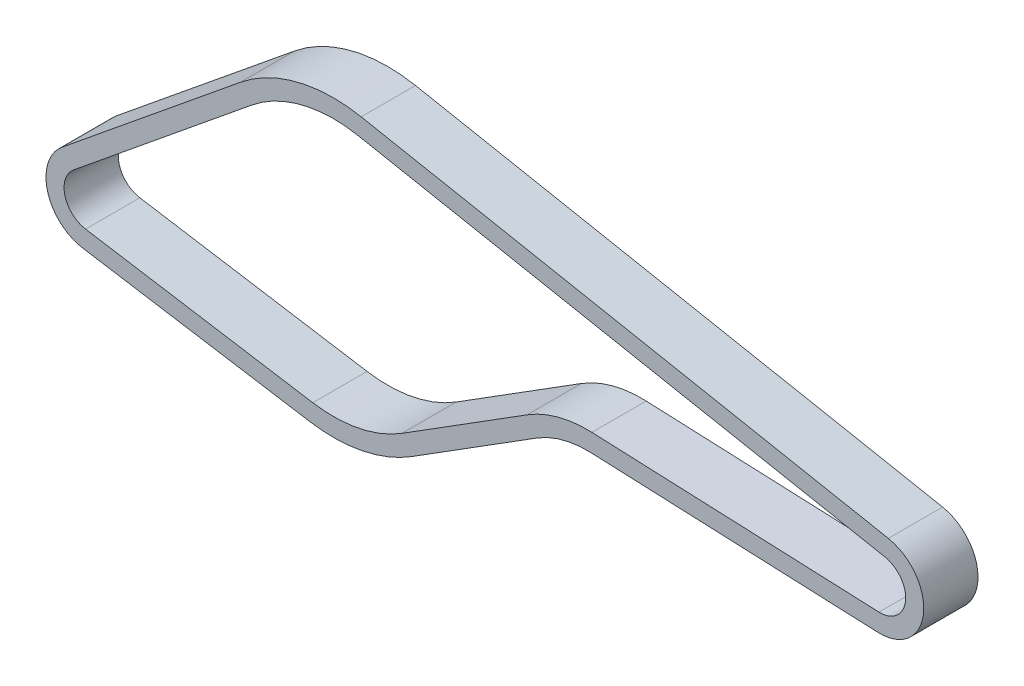
ISO-10303-21;
HEADER;
FILE_DESCRIPTION(('STEP AP214'),'2;1');
FILE_NAME('part.step','',(''),(''),'','','');
FILE_SCHEMA(('AUTOMOTIVE_DESIGN { 1 0 10303 214 1 1 1 1 }'));
ENDSEC;
DATA;
#1=APPLICATION_CONTEXT('core data for automotive mechanical design processes');
#2=APPLICATION_PROTOCOL_DEFINITION('international standard','automotive_design',2000,#1);
#3=PRODUCT_CONTEXT('',#1,'mechanical');
#4=PRODUCT('Part','Part','',(#3));
#5=PRODUCT_RELATED_PRODUCT_CATEGORY('part','',(#4));
#6=PRODUCT_DEFINITION_FORMATION('','',#4);
#7=PRODUCT_DEFINITION_CONTEXT('part definition',#1,'design');
#8=PRODUCT_DEFINITION('design','',#6,#7);
#9=PRODUCT_DEFINITION_SHAPE('','',#8);
#10=(LENGTH_UNIT() NAMED_UNIT(*) SI_UNIT(.MILLI.,.METRE.));
#11=(NAMED_UNIT(*) PLANE_ANGLE_UNIT() SI_UNIT($,.RADIAN.));
#12=(NAMED_UNIT(*) SI_UNIT($,.STERADIAN.) SOLID_ANGLE_UNIT());
#13=UNCERTAINTY_MEASURE_WITH_UNIT(LENGTH_MEASURE(1.E-05),#10,'distance_accuracy_value','');
#14=(GEOMETRIC_REPRESENTATION_CONTEXT(3) GLOBAL_UNCERTAINTY_ASSIGNED_CONTEXT((#13)) GLOBAL_UNIT_ASSIGNED_CONTEXT((#10,
#11,#12)) REPRESENTATION_CONTEXT('',''));
#15=CARTESIAN_POINT('',(0.,0.,0.));
#16=DIRECTION('',(0.,0.,1.));
#17=DIRECTION('',(1.,0.,0.));
#18=AXIS2_PLACEMENT_3D('',#15,#16,#17);
#19=CARTESIAN_POINT('',(42.0896842953628,-20.915508024351,4.5));
#20=DIRECTION('',(0.,0.,-1.));
#21=DIRECTION('',(-1.,0.,0.));
#22=AXIS2_PLACEMENT_3D('',#19,#20,#21);
#23=CYLINDRICAL_SURFACE('',#22,18.7);
#24=CARTESIAN_POINT('',(42.0896842953628,-20.915508024351,-4.5));
#25=DIRECTION('',(0.,0.,1.));
#26=DIRECTION('',(1.,0.,0.));
#27=AXIS2_PLACEMENT_3D('',#24,#25,#26);
#28=CIRCLE('',#27,18.7);
#29=CARTESIAN_POINT('',(42.8799142897922,-2.23221236871512,-4.5));
#30=VERTEX_POINT('',#29);
#31=CARTESIAN_POINT('',(32.1424472331816,-5.08065801468029,-4.5));
#32=VERTEX_POINT('',#31);
#33=EDGE_CURVE('E233',#30,#32,#28,.T.);
#34=ORIENTED_EDGE('',*,*,#33,.T.);
#35=DIRECTION('',(0.,0.,-1.));
#36=VECTOR('',#35,1.);
#37=CARTESIAN_POINT('',(32.1424472331816,-5.08065801468029,4.5));
#38=LINE('',#37,#36);
#39=CARTESIAN_POINT('',(32.1424472331816,-5.08065801468029,4.5));
#40=VERTEX_POINT('',#39);
#41=EDGE_CURVE('E11',#40,#32,#38,.T.);
#42=ORIENTED_EDGE('',*,*,#41,.F.);
#43=CARTESIAN_POINT('',(42.0896842953628,-20.915508024351,4.5));
#44=DIRECTION('',(0.,0.,1.));
#45=DIRECTION('',(1.,0.,0.));
#46=AXIS2_PLACEMENT_3D('',#43,#44,#45);
#47=CIRCLE('',#46,18.7);
#48=CARTESIAN_POINT('',(42.8799142897922,-2.23221236871512,4.5));
#49=VERTEX_POINT('',#48);
#50=EDGE_CURVE('E333',#49,#40,#47,.T.);
#51=ORIENTED_EDGE('',*,*,#50,.F.);
#52=DIRECTION('',(0.,0.,-1.));
#53=VECTOR('',#52,1.);
#54=CARTESIAN_POINT('',(42.8799142897922,-2.23221236871512,4.5));
#55=LINE('',#54,#53);
#56=EDGE_CURVE('E54',#49,#30,#55,.T.);
#57=ORIENTED_EDGE('',*,*,#56,.T.);
#58=EDGE_LOOP('',(#34,#42,#51,#57));
#59=FACE_BOUND('',#58,.T.);
#60=ADVANCED_FACE('F35',(#59),#23,.T.);
#61=CARTESIAN_POINT('',(11.3834691513731,-18.1211652517088,4.5));
#62=DIRECTION('',(-0.531937810811826,0.846783422977045,0.));
#63=DIRECTION('',(-0.846783422977045,-0.531937810811826,0.));
#64=AXIS2_PLACEMENT_3D('',#61,#62,#63);
#65=PLANE('',#64);
#66=DIRECTION('',(0.846783422977045,0.531937810811826,0.));
#67=VECTOR('',#66,1.);
#68=CARTESIAN_POINT('',(11.3834691513731,-18.1211652517088,-4.5));
#69=LINE('',#68,#67);
#70=CARTESIAN_POINT('',(11.3834691513731,-18.1211652517088,-4.5));
#71=VERTEX_POINT('',#70);
#72=EDGE_CURVE('E235',#71,#32,#69,.T.);
#73=ORIENTED_EDGE('',*,*,#72,.F.);
#74=DIRECTION('',(0.,0.,-1.));
#75=VECTOR('',#74,1.);
#76=CARTESIAN_POINT('',(11.3834691513731,-18.1211652517088,4.5));
#77=LINE('',#76,#75);
#78=CARTESIAN_POINT('',(11.3834691513731,-18.1211652517088,4.5));
#79=VERTEX_POINT('',#78);
#80=EDGE_CURVE('E45',#79,#71,#77,.T.);
#81=ORIENTED_EDGE('',*,*,#80,.F.);
#82=DIRECTION('',(0.846783422977045,0.531937810811826,0.));
#83=VECTOR('',#82,1.);
#84=CARTESIAN_POINT('',(11.3834691513731,-18.1211652517088,4.5));
#85=LINE('',#84,#83);
#86=EDGE_CURVE('E335',#79,#40,#85,.T.);
#87=ORIENTED_EDGE('',*,*,#86,.T.);
#88=ORIENTED_EDGE('',*,*,#41,.T.);
#89=EDGE_LOOP('',(#73,#81,#87,#88));
#90=FACE_BOUND('',#89,.T.);
#91=ADVANCED_FACE('F368',(#90),#65,.T.);
#92=CARTESIAN_POINT('',(0.,0.,4.5));
#93=DIRECTION('',(0.,0.,-1.));
#94=DIRECTION('',(-1.,0.,0.));
#95=AXIS2_PLACEMENT_3D('',#92,#93,#94);
#96=CYLINDRICAL_SURFACE('',#95,21.4);
#97=CARTESIAN_POINT('',(0.,0.,-4.5));
#98=DIRECTION('',(0.,0.,1.));
#99=DIRECTION('',(1.,0.,0.));
#100=AXIS2_PLACEMENT_3D('',#97,#98,#99);
#101=CIRCLE('',#100,21.4);
#102=CARTESIAN_POINT('',(-3.41714388648269,-21.1254142600583,-4.5));
#103=VERTEX_POINT('',#102);
#104=EDGE_CURVE('E238',#103,#71,#101,.T.);
#105=ORIENTED_EDGE('',*,*,#104,.F.);
#106=DIRECTION('',(0.,0.,-1.));
#107=VECTOR('',#106,1.);
#108=CARTESIAN_POINT('',(-3.41714388648269,-21.1254142600583,4.5));
#109=LINE('',#108,#107);
#110=CARTESIAN_POINT('',(-3.41714388648269,-21.1254142600583,4.5));
#111=VERTEX_POINT('',#110);
#112=EDGE_CURVE('E268',#111,#103,#109,.T.);
#113=ORIENTED_EDGE('',*,*,#112,.F.);
#114=CARTESIAN_POINT('',(0.,0.,4.5));
#115=DIRECTION('',(0.,0.,1.));
#116=DIRECTION('',(1.,0.,0.));
#117=AXIS2_PLACEMENT_3D('',#114,#115,#116);
#118=CIRCLE('',#117,21.4);
#119=EDGE_CURVE('E338',#111,#79,#118,.T.);
#120=ORIENTED_EDGE('',*,*,#119,.T.);
#121=ORIENTED_EDGE('',*,*,#80,.T.);
#122=EDGE_LOOP('',(#105,#113,#120,#121));
#123=FACE_BOUND('',#122,.T.);
#124=ADVANCED_FACE('F373',(#123),#96,.F.);
#125=CARTESIAN_POINT('',(-3.41714388648268,-21.1254142600583,4.5));
#126=DIRECTION('',(0.159679620863677,0.987168890656929,0.));
#127=DIRECTION('',(-0.987168890656929,0.159679620863677,0.));
#128=AXIS2_PLACEMENT_3D('',#125,#126,#127);
#129=PLANE('',#128);
#130=DIRECTION('',(0.987168890656929,-0.159679620863677,0.));
#131=VECTOR('',#130,1.);
#132=CARTESIAN_POINT('',(-3.41714388648268,-21.1254142600583,-4.5));
#133=LINE('',#132,#131);
#134=CARTESIAN_POINT('',(-41.1085650034415,-15.0286339717694,-4.5));
#135=VERTEX_POINT('',#134);
#136=EDGE_CURVE('E241',#135,#103,#133,.T.);
#137=ORIENTED_EDGE('',*,*,#136,.F.);
#138=DIRECTION('',(0.,0.,-1.));
#139=VECTOR('',#138,1.);
#140=CARTESIAN_POINT('',(-41.1085650034415,-15.0286339717694,4.5));
#141=LINE('',#140,#139);
#142=CARTESIAN_POINT('',(-41.1085650034415,-15.0286339717694,4.5));
#143=VERTEX_POINT('',#142);
#144=EDGE_CURVE('E266',#143,#135,#141,.T.);
#145=ORIENTED_EDGE('',*,*,#144,.F.);
#146=DIRECTION('',(0.987168890656929,-0.159679620863677,0.));
#147=VECTOR('',#146,1.);
#148=CARTESIAN_POINT('',(-3.41714388648268,-21.1254142600583,4.5));
#149=LINE('',#148,#147);
#150=EDGE_CURVE('E341',#143,#111,#149,.T.);
#151=ORIENTED_EDGE('',*,*,#150,.T.);
#152=ORIENTED_EDGE('',*,*,#112,.T.);
#153=EDGE_LOOP('',(#137,#145,#151,#152));
#154=FACE_BOUND('',#153,.T.);
#155=ADVANCED_FACE('F421',(#154),#129,.T.);
#156=CARTESIAN_POINT('',(-40.4299266147709,-10.8331661864775,4.5));
#157=DIRECTION('',(0.,0.,-1.));
#158=DIRECTION('',(-1.,0.,0.));
#159=AXIS2_PLACEMENT_3D('',#156,#157,#158);
#160=CYLINDRICAL_SURFACE('',#159,4.24999999999999);
#161=CARTESIAN_POINT('',(-40.4299266147709,-10.8331661864775,-4.5));
#162=DIRECTION('',(0.,0.,1.));
#163=DIRECTION('',(1.,0.,0.));
#164=AXIS2_PLACEMENT_3D('',#161,#162,#163);
#165=CIRCLE('',#164,4.24999999999999);
#166=CARTESIAN_POINT('',(-43.115378591989,-7.53910369799071,-4.5));
#167=VERTEX_POINT('',#166);
#168=EDGE_CURVE('E244',#167,#135,#165,.T.);
#169=ORIENTED_EDGE('',*,*,#168,.F.);
#170=DIRECTION('',(0.,0.,-1.));
#171=VECTOR('',#170,1.);
#172=CARTESIAN_POINT('',(-43.115378591989,-7.53910369799071,4.5));
#173=LINE('',#172,#171);
#174=CARTESIAN_POINT('',(-43.115378591989,-7.53910369799071,4.5));
#175=VERTEX_POINT('',#174);
#176=EDGE_CURVE('E264',#175,#167,#173,.T.);
#177=ORIENTED_EDGE('',*,*,#176,.F.);
#178=CARTESIAN_POINT('',(-40.4299266147709,-10.8331661864775,4.5));
#179=DIRECTION('',(0.,0.,1.));
#180=DIRECTION('',(1.,0.,0.));
#181=AXIS2_PLACEMENT_3D('',#178,#179,#180);
#182=CIRCLE('',#181,4.24999999999999);
#183=EDGE_CURVE('E344',#175,#143,#182,.T.);
#184=ORIENTED_EDGE('',*,*,#183,.T.);
#185=ORIENTED_EDGE('',*,*,#144,.T.);
#186=EDGE_LOOP('',(#169,#177,#184,#185));
#187=FACE_BOUND('',#186,.T.);
#188=ADVANCED_FACE('F417',(#187),#160,.F.);
#189=CARTESIAN_POINT('',(-13.5220405441099,16.5865734714392,4.5));
#190=DIRECTION('',(-0.631871053463078,0.775073526702764,0.));
#191=DIRECTION('',(-0.775073526702764,-0.631871053463078,0.));
#192=AXIS2_PLACEMENT_3D('',#189,#190,#191);
#193=PLANE('',#192);
#194=DIRECTION('',(0.775073526702764,0.631871053463078,0.));
#195=VECTOR('',#194,1.);
#196=CARTESIAN_POINT('',(-13.5220405441099,16.5865734714392,-4.5));
#197=LINE('',#196,#195);
#198=CARTESIAN_POINT('',(-13.5220405441099,16.5865734714392,-4.5));
#199=VERTEX_POINT('',#198);
#200=EDGE_CURVE('E247',#167,#199,#197,.T.);
#201=ORIENTED_EDGE('',*,*,#200,.T.);
#202=DIRECTION('',(0.,0.,-1.));
#203=VECTOR('',#202,1.);
#204=CARTESIAN_POINT('',(-13.5220405441099,16.5865734714392,4.5));
#205=LINE('',#204,#203);
#206=CARTESIAN_POINT('',(-13.5220405441099,16.5865734714392,4.5));
#207=VERTEX_POINT('',#206);
#208=EDGE_CURVE('E262',#207,#199,#205,.T.);
#209=ORIENTED_EDGE('',*,*,#208,.F.);
#210=DIRECTION('',(0.775073526702764,0.631871053463078,0.));
#211=VECTOR('',#210,1.);
#212=CARTESIAN_POINT('',(-13.5220405441099,16.5865734714392,4.5));
#213=LINE('',#212,#211);
#214=EDGE_CURVE('E347',#175,#207,#213,.T.);
#215=ORIENTED_EDGE('',*,*,#214,.F.);
#216=ORIENTED_EDGE('',*,*,#176,.T.);
#217=EDGE_LOOP('',(#201,#209,#215,#216));
#218=FACE_BOUND('',#217,.T.);
#219=ADVANCED_FACE('F414',(#218),#193,.F.);
#220=CARTESIAN_POINT('',(0.,0.,4.5));
#221=DIRECTION('',(0.,0.,-1.));
#222=DIRECTION('',(-1.,0.,0.));
#223=AXIS2_PLACEMENT_3D('',#220,#221,#222);
#224=CYLINDRICAL_SURFACE('',#223,21.4);
#225=CARTESIAN_POINT('',(0.,0.,-4.5));
#226=DIRECTION('',(0.,0.,1.));
#227=DIRECTION('',(1.,0.,0.));
#228=AXIS2_PLACEMENT_3D('',#225,#226,#227);
#229=CIRCLE('',#228,21.4);
#230=CARTESIAN_POINT('',(4.047486865877,21.0137538310163,-4.5));
#231=VERTEX_POINT('',#230);
#232=EDGE_CURVE('E250',#231,#199,#229,.T.);
#233=ORIENTED_EDGE('',*,*,#232,.F.);
#234=DIRECTION('',(0.,0.,-1.));
#235=VECTOR('',#234,1.);
#236=CARTESIAN_POINT('',(4.047486865877,21.0137538310163,4.5));
#237=LINE('',#236,#235);
#238=CARTESIAN_POINT('',(4.047486865877,21.0137538310163,4.5));
#239=VERTEX_POINT('',#238);
#240=EDGE_CURVE('E198',#239,#231,#237,.T.);
#241=ORIENTED_EDGE('',*,*,#240,.F.);
#242=CARTESIAN_POINT('',(0.,0.,4.5));
#243=DIRECTION('',(0.,0.,1.));
#244=DIRECTION('',(1.,0.,0.));
#245=AXIS2_PLACEMENT_3D('',#242,#243,#244);
#246=CIRCLE('',#245,21.4);
#247=EDGE_CURVE('E188',#239,#207,#246,.T.);
#248=ORIENTED_EDGE('',*,*,#247,.T.);
#249=ORIENTED_EDGE('',*,*,#208,.T.);
#250=EDGE_LOOP('',(#233,#241,#248,#249));
#251=FACE_BOUND('',#250,.T.);
#252=ADVANCED_FACE('F350',(#251),#224,.F.);
#253=CARTESIAN_POINT('',(4.047486865877,21.0137538310163,4.5));
#254=DIRECTION('',(0.189134900274626,0.981951113598894,0.));
#255=DIRECTION('',(-0.981951113598894,0.189134900274626,0.));
#256=AXIS2_PLACEMENT_3D('',#253,#254,#255);
#257=PLANE('',#256);
#258=DIRECTION('',(0.981951113598894,-0.189134900274626,0.));
#259=VECTOR('',#258,1.);
#260=CARTESIAN_POINT('',(4.047486865877,21.0137538310163,-4.5));
#261=LINE('',#260,#259);
#262=CARTESIAN_POINT('',(91.4798433261672,4.1732922327953,-4.5));
#263=VERTEX_POINT('',#262);
#264=EDGE_CURVE('E195',#231,#263,#261,.T.);
#265=ORIENTED_EDGE('',*,*,#264,.T.);
#266=DIRECTION('',(0.,0.,-1.));
#267=VECTOR('',#266,1.);
#268=CARTESIAN_POINT('',(91.4798433261672,4.1732922327953,4.5));
#269=LINE('',#268,#267);
#270=CARTESIAN_POINT('',(91.4798433261672,4.1732922327953,4.5));
#271=VERTEX_POINT('',#270);
#272=EDGE_CURVE('E192',#271,#263,#269,.T.);
#273=ORIENTED_EDGE('',*,*,#272,.F.);
#274=DIRECTION('',(0.981951113598894,-0.189134900274626,0.));
#275=VECTOR('',#274,1.);
#276=CARTESIAN_POINT('',(4.047486865877,21.0137538310163,4.5));
#277=LINE('',#276,#275);
#278=EDGE_CURVE('E181',#239,#271,#277,.T.);
#279=ORIENTED_EDGE('',*,*,#278,.F.);
#280=ORIENTED_EDGE('',*,*,#240,.T.);
#281=EDGE_LOOP('',(#265,#273,#279,#280));
#282=FACE_BOUND('',#281,.T.);
#283=ADVANCED_FACE('F193',(#282),#257,.F.);
#284=CARTESIAN_POINT('',(90.67602,0.,4.5));
#285=DIRECTION('',(0.,0.,-1.));
#286=DIRECTION('',(-1.,0.,0.));
#287=AXIS2_PLACEMENT_3D('',#284,#285,#286);
#288=CYLINDRICAL_SURFACE('',#287,4.25);
#289=CARTESIAN_POINT('',(90.67602,0.,-4.5));
#290=DIRECTION('',(0.,0.,1.));
#291=DIRECTION('',(1.,0.,0.));
#292=AXIS2_PLACEMENT_3D('',#289,#290,#291);
#293=CIRCLE('',#292,4.25);
#294=CARTESIAN_POINT('',(90.4964222739933,-4.24620355809907,-4.5));
#295=VERTEX_POINT('',#294);
#296=EDGE_CURVE('E254',#295,#263,#293,.T.);
#297=ORIENTED_EDGE('',*,*,#296,.F.);
#298=DIRECTION('',(0.,0.,-1.));
#299=VECTOR('',#298,1.);
#300=CARTESIAN_POINT('',(90.4964222739933,-4.24620355809907,4.5));
#301=LINE('',#300,#299);
#302=CARTESIAN_POINT('',(90.4964222739933,-4.24620355809907,4.5));
#303=VERTEX_POINT('',#302);
#304=EDGE_CURVE('E115',#303,#295,#301,.T.);
#305=ORIENTED_EDGE('',*,*,#304,.F.);
#306=CARTESIAN_POINT('',(90.67602,0.,4.5));
#307=DIRECTION('',(0.,0.,1.));
#308=DIRECTION('',(1.,0.,0.));
#309=AXIS2_PLACEMENT_3D('',#306,#307,#308);
#310=CIRCLE('',#309,4.25);
#311=EDGE_CURVE('E186',#303,#271,#310,.T.);
#312=ORIENTED_EDGE('',*,*,#311,.T.);
#313=ORIENTED_EDGE('',*,*,#272,.T.);
#314=EDGE_LOOP('',(#297,#305,#312,#313));
#315=FACE_BOUND('',#314,.T.);
#316=ADVANCED_FACE('F200',(#315),#288,.F.);
#317=CARTESIAN_POINT('',(12.9792825838086,-20.6615155206399,4.5));
#318=DIRECTION('',(-0.531937810811826,0.846783422977046,0.));
#319=DIRECTION('',(-0.846783422977046,-0.531937810811826,0.));
#320=AXIS2_PLACEMENT_3D('',#317,#318,#319);
#321=PLANE('',#320);
#322=DIRECTION('',(0.846783422977046,0.531937810811826,0.));
#323=VECTOR('',#322,1.);
#324=CARTESIAN_POINT('',(12.9792825838086,-20.6615155206399,-4.5));
#325=LINE('',#324,#323);
#326=CARTESIAN_POINT('',(12.9792825838086,-20.6615155206399,-4.5));
#327=VERTEX_POINT('',#326);
#328=CARTESIAN_POINT('',(33.7382606656171,-7.62100828361144,-4.5));
#329=VERTEX_POINT('',#328);
#330=EDGE_CURVE('E207',#327,#329,#325,.T.);
#331=ORIENTED_EDGE('',*,*,#330,.T.);
#332=DIRECTION('',(0.,0.,-1.));
#333=VECTOR('',#332,1.);
#334=CARTESIAN_POINT('',(33.7382606656171,-7.62100828361144,4.5));
#335=LINE('',#334,#333);
#336=CARTESIAN_POINT('',(33.7382606656171,-7.62100828361144,4.5));
#337=VERTEX_POINT('',#336);
#338=EDGE_CURVE('E39',#337,#329,#335,.T.);
#339=ORIENTED_EDGE('',*,*,#338,.F.);
#340=DIRECTION('',(0.846783422977046,0.531937810811826,0.));
#341=VECTOR('',#340,1.);
#342=CARTESIAN_POINT('',(12.9792825838086,-20.6615155206399,4.5));
#343=LINE('',#342,#341);
#344=CARTESIAN_POINT('',(12.9792825838086,-20.6615155206399,4.5));
#345=VERTEX_POINT('',#344);
#346=EDGE_CURVE('E128',#345,#337,#343,.T.);
#347=ORIENTED_EDGE('',*,*,#346,.F.);
#348=DIRECTION('',(0.,0.,-1.));
#349=VECTOR('',#348,1.);
#350=CARTESIAN_POINT('',(12.9792825838086,-20.6615155206399,4.5));
#351=LINE('',#350,#349);
#352=EDGE_CURVE('E203',#345,#327,#351,.T.);
#353=ORIENTED_EDGE('',*,*,#352,.T.);
#354=EDGE_LOOP('',(#331,#339,#347,#353));
#355=FACE_BOUND('',#354,.T.);
#356=ADVANCED_FACE('F37',(#355),#321,.F.);
#357=CARTESIAN_POINT('',(42.0896842953628,-20.915508024351,4.5));
#358=DIRECTION('',(0.,0.,-1.));
#359=DIRECTION('',(-1.,0.,0.));
#360=AXIS2_PLACEMENT_3D('',#357,#358,#359);
#361=CYLINDRICAL_SURFACE('',#360,15.7);
#362=CARTESIAN_POINT('',(42.0896842953628,-20.915508024351,-4.5));
#363=DIRECTION('',(0.,0.,1.));
#364=DIRECTION('',(1.,0.,0.));
#365=AXIS2_PLACEMENT_3D('',#362,#363,#364);
#366=CIRCLE('',#365,15.7);
#367=CARTESIAN_POINT('',(42.7531394243757,-5.22953252737329,-4.5));
#368=VERTEX_POINT('',#367);
#369=EDGE_CURVE('E210',#368,#329,#366,.T.);
#370=ORIENTED_EDGE('',*,*,#369,.F.);
#371=DIRECTION('',(0.,0.,-1.));
#372=VECTOR('',#371,1.);
#373=CARTESIAN_POINT('',(42.7531394243757,-5.22953252737329,4.5));
#374=LINE('',#373,#372);
#375=CARTESIAN_POINT('',(42.7531394243757,-5.22953252737329,4.5));
#376=VERTEX_POINT('',#375);
#377=EDGE_CURVE('E289',#376,#368,#374,.T.);
#378=ORIENTED_EDGE('',*,*,#377,.F.);
#379=CARTESIAN_POINT('',(42.0896842953628,-20.915508024351,4.5));
#380=DIRECTION('',(0.,0.,1.));
#381=DIRECTION('',(1.,0.,0.));
#382=AXIS2_PLACEMENT_3D('',#379,#380,#381);
#383=CIRCLE('',#382,15.7);
#384=EDGE_CURVE('E297',#376,#337,#383,.T.);
#385=ORIENTED_EDGE('',*,*,#384,.T.);
#386=ORIENTED_EDGE('',*,*,#338,.T.);
#387=EDGE_LOOP('',(#370,#378,#385,#386));
#388=FACE_BOUND('',#387,.T.);
#389=ADVANCED_FACE('F296',(#388),#361,.F.);
#390=CARTESIAN_POINT('',(-0.144446714943686,-3.41513319008685,4.5));
#391=DIRECTION('',(0.0422582884721645,0.999106719552723,0.));
#392=DIRECTION('',(-0.999106719552723,0.0422582884721645,0.));
#393=AXIS2_PLACEMENT_3D('',#390,#391,#392);
#394=PLANE('',#393);
#395=DIRECTION('',(0.999106719552723,-0.0422582884721645,0.));
#396=VECTOR('',#395,1.);
#397=CARTESIAN_POINT('',(-0.144446714943686,-3.41513319008685,-4.5));
#398=LINE('',#397,#396);
#399=CARTESIAN_POINT('',(90.3696474085768,-7.24352371675725,-4.5));
#400=VERTEX_POINT('',#399);
#401=EDGE_CURVE('E213',#368,#400,#398,.T.);
#402=ORIENTED_EDGE('',*,*,#401,.T.);
#403=DIRECTION('',(0.,0.,-1.));
#404=VECTOR('',#403,1.);
#405=CARTESIAN_POINT('',(90.3696474085768,-7.24352371675725,4.5));
#406=LINE('',#405,#404);
#407=CARTESIAN_POINT('',(90.3696474085768,-7.24352371675725,4.5));
#408=VERTEX_POINT('',#407);
#409=EDGE_CURVE('E287',#408,#400,#406,.T.);
#410=ORIENTED_EDGE('',*,*,#409,.F.);
#411=DIRECTION('',(0.999106719552723,-0.0422582884721645,0.));
#412=VECTOR('',#411,1.);
#413=CARTESIAN_POINT('',(-0.144446714943686,-3.41513319008685,4.5));
#414=LINE('',#413,#412);
#415=EDGE_CURVE('E316',#376,#408,#414,.T.);
#416=ORIENTED_EDGE('',*,*,#415,.F.);
#417=ORIENTED_EDGE('',*,*,#377,.T.);
#418=EDGE_LOOP('',(#402,#410,#416,#417));
#419=FACE_BOUND('',#418,.T.);
#420=ADVANCED_FACE('F307',(#419),#394,.F.);
#421=CARTESIAN_POINT('',(90.67602,0.,4.5));
#422=DIRECTION('',(0.,0.,-1.));
#423=DIRECTION('',(-1.,0.,0.));
#424=AXIS2_PLACEMENT_3D('',#421,#422,#423);
#425=CYLINDRICAL_SURFACE('',#424,7.25000000000001);
#426=CARTESIAN_POINT('',(90.67602,0.,-4.5));
#427=DIRECTION('',(0.,0.,1.));
#428=DIRECTION('',(1.,0.,0.));
#429=AXIS2_PLACEMENT_3D('',#426,#427,#428);
#430=CIRCLE('',#429,7.25000000000001);
#431=CARTESIAN_POINT('',(92.0472480269911,7.11914557359198,-4.5));
#432=VERTEX_POINT('',#431);
#433=EDGE_CURVE('E215',#400,#432,#430,.T.);
#434=ORIENTED_EDGE('',*,*,#433,.T.);
#435=DIRECTION('',(0.,0.,-1.));
#436=VECTOR('',#435,1.);
#437=CARTESIAN_POINT('',(92.0472480269911,7.11914557359198,4.5));
#438=LINE('',#437,#436);
#439=CARTESIAN_POINT('',(92.0472480269911,7.11914557359198,4.5));
#440=VERTEX_POINT('',#439);
#441=EDGE_CURVE('E285',#440,#432,#438,.T.);
#442=ORIENTED_EDGE('',*,*,#441,.F.);
#443=CARTESIAN_POINT('',(90.67602,0.,4.5));
#444=DIRECTION('',(0.,0.,1.));
#445=DIRECTION('',(1.,0.,0.));
#446=AXIS2_PLACEMENT_3D('',#443,#444,#445);
#447=CIRCLE('',#446,7.25000000000001);
#448=EDGE_CURVE('E312',#408,#440,#447,.T.);
#449=ORIENTED_EDGE('',*,*,#448,.F.);
#450=ORIENTED_EDGE('',*,*,#409,.T.);
#451=EDGE_LOOP('',(#434,#442,#449,#450));
#452=FACE_BOUND('',#451,.T.);
#453=ADVANCED_FACE('F310',(#452),#425,.T.);
#454=CARTESIAN_POINT('',(4.61489156670088,23.959607171813,4.5));
#455=DIRECTION('',(0.189134900274626,0.981951113598894,0.));
#456=DIRECTION('',(-0.981951113598894,0.189134900274626,0.));
#457=AXIS2_PLACEMENT_3D('',#454,#455,#456);
#458=PLANE('',#457);
#459=DIRECTION('',(0.981951113598894,-0.189134900274626,0.));
#460=VECTOR('',#459,1.);
#461=CARTESIAN_POINT('',(4.61489156670088,23.959607171813,-4.5));
#462=LINE('',#461,#460);
#463=CARTESIAN_POINT('',(4.61489156670088,23.959607171813,-4.5));
#464=VERTEX_POINT('',#463);
#465=EDGE_CURVE('E218',#464,#432,#462,.T.);
#466=ORIENTED_EDGE('',*,*,#465,.F.);
#467=DIRECTION('',(0.,0.,-1.));
#468=VECTOR('',#467,1.);
#469=CARTESIAN_POINT('',(4.61489156670088,23.959607171813,4.5));
#470=LINE('',#469,#468);
#471=CARTESIAN_POINT('',(4.61489156670088,23.959607171813,4.5));
#472=VERTEX_POINT('',#471);
#473=EDGE_CURVE('E283',#472,#464,#470,.T.);
#474=ORIENTED_EDGE('',*,*,#473,.F.);
#475=DIRECTION('',(0.981951113598894,-0.189134900274626,0.));
#476=VECTOR('',#475,1.);
#477=CARTESIAN_POINT('',(4.61489156670088,23.959607171813,4.5));
#478=LINE('',#477,#476);
#479=EDGE_CURVE('E315',#472,#440,#478,.T.);
#480=ORIENTED_EDGE('',*,*,#479,.T.);
#481=ORIENTED_EDGE('',*,*,#441,.T.);
#482=EDGE_LOOP('',(#466,#474,#480,#481));
#483=FACE_BOUND('',#482,.T.);
#484=ADVANCED_FACE('F392',(#483),#458,.T.);
#485=CARTESIAN_POINT('',(0.,0.,4.5));
#486=DIRECTION('',(0.,0.,-1.));
#487=DIRECTION('',(-1.,0.,0.));
#488=AXIS2_PLACEMENT_3D('',#485,#486,#487);
#489=CYLINDRICAL_SURFACE('',#488,24.4);
#490=CARTESIAN_POINT('',(0.,0.,-4.5));
#491=DIRECTION('',(0.,0.,1.));
#492=DIRECTION('',(1.,0.,0.));
#493=AXIS2_PLACEMENT_3D('',#490,#491,#492);
#494=CIRCLE('',#493,24.4);
#495=CARTESIAN_POINT('',(-15.4176537044991,18.9117940515474,-4.5));
#496=VERTEX_POINT('',#495);
#497=EDGE_CURVE('E221',#464,#496,#494,.T.);
#498=ORIENTED_EDGE('',*,*,#497,.T.);
#499=DIRECTION('',(0.,0.,-1.));
#500=VECTOR('',#499,1.);
#501=CARTESIAN_POINT('',(-15.4176537044991,18.9117940515474,4.5));
#502=LINE('',#501,#500);
#503=CARTESIAN_POINT('',(-15.4176537044991,18.9117940515474,4.5));
#504=VERTEX_POINT('',#503);
#505=EDGE_CURVE('E281',#504,#496,#502,.T.);
#506=ORIENTED_EDGE('',*,*,#505,.F.);
#507=CARTESIAN_POINT('',(0.,0.,4.5));
#508=DIRECTION('',(0.,0.,1.));
#509=DIRECTION('',(1.,0.,0.));
#510=AXIS2_PLACEMENT_3D('',#507,#508,#509);
#511=CIRCLE('',#510,24.4);
#512=EDGE_CURVE('E318',#472,#504,#511,.T.);
#513=ORIENTED_EDGE('',*,*,#512,.F.);
#514=ORIENTED_EDGE('',*,*,#473,.T.);
#515=EDGE_LOOP('',(#498,#506,#513,#514));
#516=FACE_BOUND('',#515,.T.);
#517=ADVANCED_FACE('F388',(#516),#489,.T.);
#518=CARTESIAN_POINT('',(-15.4176537044991,18.9117940515474,4.5));
#519=DIRECTION('',(-0.631871053463078,0.775073526702764,0.));
#520=DIRECTION('',(-0.775073526702764,-0.631871053463078,0.));
#521=AXIS2_PLACEMENT_3D('',#518,#519,#520);
#522=PLANE('',#521);
#523=DIRECTION('',(0.775073526702764,0.631871053463078,0.));
#524=VECTOR('',#523,1.);
#525=CARTESIAN_POINT('',(-15.4176537044991,18.9117940515474,-4.5));
#526=LINE('',#525,#524);
#527=CARTESIAN_POINT('',(-45.0109917523782,-5.21388311788242,-4.5));
#528=VERTEX_POINT('',#527);
#529=EDGE_CURVE('E224',#528,#496,#526,.T.);
#530=ORIENTED_EDGE('',*,*,#529,.F.);
#531=DIRECTION('',(0.,0.,-1.));
#532=VECTOR('',#531,1.);
#533=CARTESIAN_POINT('',(-45.0109917523782,-5.21388311788242,4.5));
#534=LINE('',#533,#532);
#535=CARTESIAN_POINT('',(-45.0109917523782,-5.21388311788242,4.5));
#536=VERTEX_POINT('',#535);
#537=EDGE_CURVE('E279',#536,#528,#534,.T.);
#538=ORIENTED_EDGE('',*,*,#537,.F.);
#539=DIRECTION('',(0.775073526702764,0.631871053463078,0.));
#540=VECTOR('',#539,1.);
#541=CARTESIAN_POINT('',(-15.4176537044991,18.9117940515474,4.5));
#542=LINE('',#541,#540);
#543=EDGE_CURVE('E324',#536,#504,#542,.T.);
#544=ORIENTED_EDGE('',*,*,#543,.T.);
#545=ORIENTED_EDGE('',*,*,#505,.T.);
#546=EDGE_LOOP('',(#530,#538,#544,#545));
#547=FACE_BOUND('',#546,.T.);
#548=ADVANCED_FACE('F384',(#547),#522,.T.);
#549=CARTESIAN_POINT('',(-40.4299266147709,-10.8331661864775,4.5));
#550=DIRECTION('',(0.,0.,-1.));
#551=DIRECTION('',(-1.,0.,0.));
#552=AXIS2_PLACEMENT_3D('',#549,#550,#551);
#553=CYLINDRICAL_SURFACE('',#552,7.25);
#554=CARTESIAN_POINT('',(-40.4299266147709,-10.8331661864775,-4.5));
#555=DIRECTION('',(0.,0.,1.));
#556=DIRECTION('',(1.,0.,0.));
#557=AXIS2_PLACEMENT_3D('',#554,#555,#556);
#558=CIRCLE('',#557,7.25);
#559=CARTESIAN_POINT('',(-41.5876038660326,-17.9901406437402,-4.5));
#560=VERTEX_POINT('',#559);
#561=EDGE_CURVE('E227',#528,#560,#558,.T.);
#562=ORIENTED_EDGE('',*,*,#561,.T.);
#563=DIRECTION('',(0.,0.,-1.));
#564=VECTOR('',#563,1.);
#565=CARTESIAN_POINT('',(-41.5876038660326,-17.9901406437402,4.5));
#566=LINE('',#565,#564);
#567=CARTESIAN_POINT('',(-41.5876038660326,-17.9901406437402,4.5));
#568=VERTEX_POINT('',#567);
#569=EDGE_CURVE('E276',#568,#560,#566,.T.);
#570=ORIENTED_EDGE('',*,*,#569,.F.);
#571=CARTESIAN_POINT('',(-40.4299266147709,-10.8331661864775,4.5));
#572=DIRECTION('',(0.,0.,1.));
#573=DIRECTION('',(1.,0.,0.));
#574=AXIS2_PLACEMENT_3D('',#571,#572,#573);
#575=CIRCLE('',#574,7.25);
#576=EDGE_CURVE('E327',#536,#568,#575,.T.);
#577=ORIENTED_EDGE('',*,*,#576,.F.);
#578=ORIENTED_EDGE('',*,*,#537,.T.);
#579=EDGE_LOOP('',(#562,#570,#577,#578));
#580=FACE_BOUND('',#579,.T.);
#581=ADVANCED_FACE('F380',(#580),#553,.T.);
#582=CARTESIAN_POINT('',(-3.89618274907372,-24.0869209320291,4.5));
#583=DIRECTION('',(0.159679620863677,0.987168890656929,0.));
#584=DIRECTION('',(-0.987168890656929,0.159679620863677,0.));
#585=AXIS2_PLACEMENT_3D('',#582,#583,#584);
#586=PLANE('',#585);
#587=DIRECTION('',(0.987168890656929,-0.159679620863677,0.));
#588=VECTOR('',#587,1.);
#589=CARTESIAN_POINT('',(-3.89618274907372,-24.0869209320291,-4.5));
#590=LINE('',#589,#588);
#591=CARTESIAN_POINT('',(-3.89618274907372,-24.0869209320291,-4.5));
#592=VERTEX_POINT('',#591);
#593=EDGE_CURVE('E229',#560,#592,#590,.T.);
#594=ORIENTED_EDGE('',*,*,#593,.T.);
#595=DIRECTION('',(0.,0.,-1.));
#596=VECTOR('',#595,1.);
#597=CARTESIAN_POINT('',(-3.89618274907372,-24.0869209320291,4.5));
#598=LINE('',#597,#596);
#599=CARTESIAN_POINT('',(-3.89618274907372,-24.0869209320291,4.5));
#600=VERTEX_POINT('',#599);
#601=EDGE_CURVE('E273',#600,#592,#598,.T.);
#602=ORIENTED_EDGE('',*,*,#601,.F.);
#603=DIRECTION('',(0.987168890656929,-0.159679620863677,0.));
#604=VECTOR('',#603,1.);
#605=CARTESIAN_POINT('',(-3.89618274907372,-24.0869209320291,4.5));
#606=LINE('',#605,#604);
#607=EDGE_CURVE('E329',#568,#600,#606,.T.);
#608=ORIENTED_EDGE('',*,*,#607,.F.);
#609=ORIENTED_EDGE('',*,*,#569,.T.);
#610=EDGE_LOOP('',(#594,#602,#608,#609));
#611=FACE_BOUND('',#610,.T.);
#612=ADVANCED_FACE('F362',(#611),#586,.F.);
#613=CARTESIAN_POINT('',(0.,0.,4.5));
#614=DIRECTION('',(0.,0.,-1.));
#615=DIRECTION('',(-1.,0.,0.));
#616=AXIS2_PLACEMENT_3D('',#613,#614,#615);
#617=CYLINDRICAL_SURFACE('',#616,24.4);
#618=CARTESIAN_POINT('',(0.,0.,-4.5));
#619=DIRECTION('',(0.,0.,1.));
#620=DIRECTION('',(1.,0.,0.));
#621=AXIS2_PLACEMENT_3D('',#618,#619,#620);
#622=CIRCLE('',#621,24.4);
#623=EDGE_CURVE('E231',#592,#327,#622,.T.);
#624=ORIENTED_EDGE('',*,*,#623,.T.);
#625=ORIENTED_EDGE('',*,*,#352,.F.);
#626=CARTESIAN_POINT('',(0.,0.,4.5));
#627=DIRECTION('',(0.,0.,1.));
#628=DIRECTION('',(1.,0.,0.));
#629=AXIS2_PLACEMENT_3D('',#626,#627,#628);
#630=CIRCLE('',#629,24.4);
#631=EDGE_CURVE('E331',#600,#345,#630,.T.);
#632=ORIENTED_EDGE('',*,*,#631,.F.);
#633=ORIENTED_EDGE('',*,*,#601,.T.);
#634=EDGE_LOOP('',(#624,#625,#632,#633));
#635=FACE_BOUND('',#634,.T.);
#636=ADVANCED_FACE('F355',(#635),#617,.T.);
#637=CARTESIAN_POINT('',(-0.0176718495271924,-0.417813031428676,4.5));
#638=DIRECTION('',(0.0422582884721645,0.999106719552723,0.));
#639=DIRECTION('',(-0.999106719552723,0.0422582884721646,0.));
#640=AXIS2_PLACEMENT_3D('',#637,#638,#639);
#641=PLANE('',#640);
#642=DIRECTION('',(0.999106719552723,-0.0422582884721646,0.));
#643=VECTOR('',#642,1.);
#644=CARTESIAN_POINT('',(-0.0176718495271924,-0.417813031428676,-4.5));
#645=LINE('',#644,#643);
#646=EDGE_CURVE('E256',#30,#295,#645,.T.);
#647=ORIENTED_EDGE('',*,*,#646,.F.);
#648=ORIENTED_EDGE('',*,*,#56,.F.);
#649=DIRECTION('',(0.999106719552723,-0.0422582884721646,0.));
#650=VECTOR('',#649,1.);
#651=CARTESIAN_POINT('',(-0.0176718495271924,-0.417813031428676,4.5));
#652=LINE('',#651,#650);
#653=EDGE_CURVE('E201',#49,#303,#652,.T.);
#654=ORIENTED_EDGE('',*,*,#653,.T.);
#655=ORIENTED_EDGE('',*,*,#304,.T.);
#656=EDGE_LOOP('',(#647,#648,#654,#655));
#657=FACE_BOUND('',#656,.T.);
#658=ADVANCED_FACE('F353',(#657),#641,.T.);
#659=CARTESIAN_POINT('',(0.,0.,4.5));
#660=DIRECTION('',(0.,0.,1.));
#661=DIRECTION('',(1.,0.,0.));
#662=AXIS2_PLACEMENT_3D('',#659,#660,#661);
#663=PLANE('',#662);
#664=ORIENTED_EDGE('',*,*,#346,.T.);
#665=ORIENTED_EDGE('',*,*,#384,.F.);
#666=ORIENTED_EDGE('',*,*,#415,.T.);
#667=ORIENTED_EDGE('',*,*,#448,.T.);
#668=ORIENTED_EDGE('',*,*,#479,.F.);
#669=ORIENTED_EDGE('',*,*,#512,.T.);
#670=ORIENTED_EDGE('',*,*,#543,.F.);
#671=ORIENTED_EDGE('',*,*,#576,.T.);
#672=ORIENTED_EDGE('',*,*,#607,.T.);
#673=ORIENTED_EDGE('',*,*,#631,.T.);
#674=EDGE_LOOP('',(#664,#665,#666,#667,#668,#669,#670,#671,#672,#673));
#675=FACE_BOUND('',#674,.T.);
#676=ORIENTED_EDGE('',*,*,#50,.T.);
#677=ORIENTED_EDGE('',*,*,#86,.F.);
#678=ORIENTED_EDGE('',*,*,#119,.F.);
#679=ORIENTED_EDGE('',*,*,#150,.F.);
#680=ORIENTED_EDGE('',*,*,#183,.F.);
#681=ORIENTED_EDGE('',*,*,#214,.T.);
#682=ORIENTED_EDGE('',*,*,#247,.F.);
#683=ORIENTED_EDGE('',*,*,#278,.T.);
#684=ORIENTED_EDGE('',*,*,#311,.F.);
#685=ORIENTED_EDGE('',*,*,#653,.F.);
#686=EDGE_LOOP('',(#676,#677,#678,#679,#680,#681,#682,#683,#684,#685));
#687=FACE_BOUND('',#686,.T.);
#688=ADVANCED_FACE('F183',(#675,#687),#663,.T.);
#689=CARTESIAN_POINT('',(0.,0.,-4.5));
#690=DIRECTION('',(0.,0.,1.));
#691=DIRECTION('',(1.,0.,0.));
#692=AXIS2_PLACEMENT_3D('',#689,#690,#691);
#693=PLANE('',#692);
#694=ORIENTED_EDGE('',*,*,#330,.F.);
#695=ORIENTED_EDGE('',*,*,#623,.F.);
#696=ORIENTED_EDGE('',*,*,#593,.F.);
#697=ORIENTED_EDGE('',*,*,#561,.F.);
#698=ORIENTED_EDGE('',*,*,#529,.T.);
#699=ORIENTED_EDGE('',*,*,#497,.F.);
#700=ORIENTED_EDGE('',*,*,#465,.T.);
#701=ORIENTED_EDGE('',*,*,#433,.F.);
#702=ORIENTED_EDGE('',*,*,#401,.F.);
#703=ORIENTED_EDGE('',*,*,#369,.T.);
#704=EDGE_LOOP('',(#694,#695,#696,#697,#698,#699,#700,#701,#702,#703));
#705=FACE_BOUND('',#704,.T.);
#706=ORIENTED_EDGE('',*,*,#33,.F.);
#707=ORIENTED_EDGE('',*,*,#646,.T.);
#708=ORIENTED_EDGE('',*,*,#296,.T.);
#709=ORIENTED_EDGE('',*,*,#264,.F.);
#710=ORIENTED_EDGE('',*,*,#232,.T.);
#711=ORIENTED_EDGE('',*,*,#200,.F.);
#712=ORIENTED_EDGE('',*,*,#168,.T.);
#713=ORIENTED_EDGE('',*,*,#136,.T.);
#714=ORIENTED_EDGE('',*,*,#104,.T.);
#715=ORIENTED_EDGE('',*,*,#72,.T.);
#716=EDGE_LOOP('',(#706,#707,#708,#709,#710,#711,#712,#713,#714,#715));
#717=FACE_BOUND('',#716,.T.);
#718=ADVANCED_FACE('F303',(#705,#717),#693,.F.);
#719=CLOSED_SHELL('',(#60,#91,#124,#155,#188,#219,#252,#283,#316,#356,#389,#420,#453,#484,#517,
#548,#581,#612,#636,#658,#688,#718));
#720=MANIFOLD_SOLID_BREP('B2',#719);
#721=ADVANCED_BREP_SHAPE_REPRESENTATION('',(#18,#720),#14);
#722=SHAPE_DEFINITION_REPRESENTATION(#9,#721);
ENDSEC;
END-ISO-10303-21;
